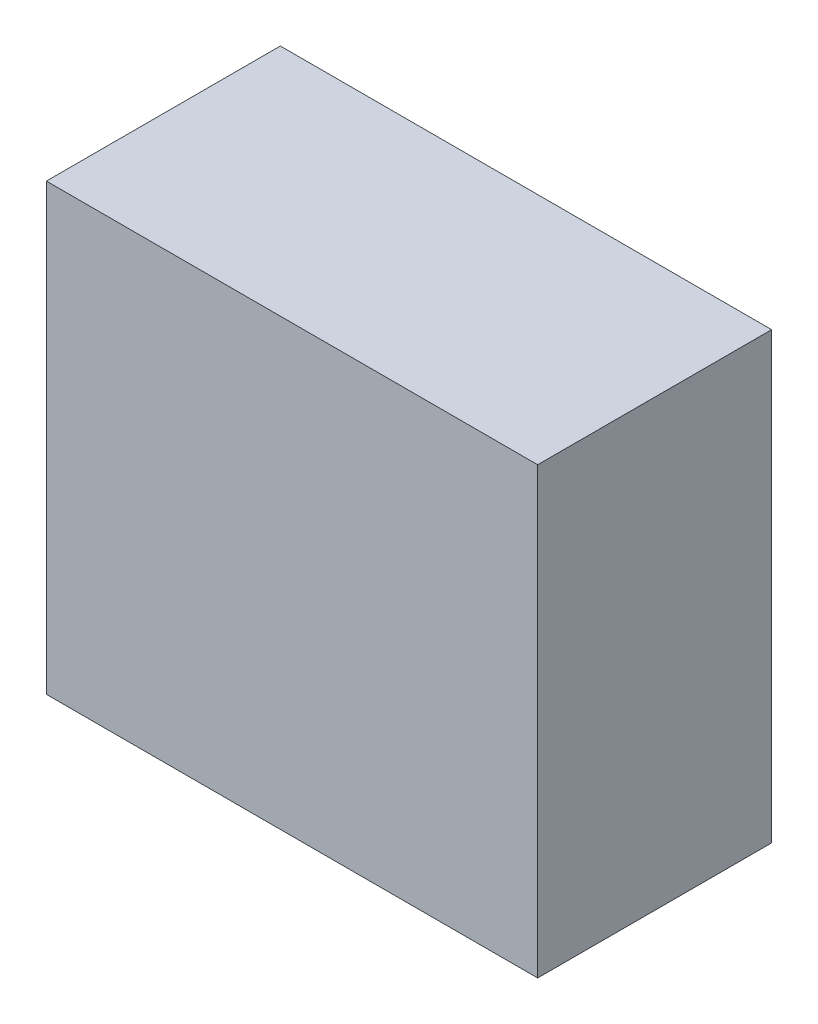
ISO-10303-21;
HEADER;
FILE_DESCRIPTION(('STEP AP214'),'2;1');
FILE_NAME('part.step','',(''),(''),'','','');
FILE_SCHEMA(('AUTOMOTIVE_DESIGN { 1 0 10303 214 1 1 1 1 }'));
ENDSEC;
DATA;
#1=APPLICATION_CONTEXT('core data for automotive mechanical design processes');
#2=APPLICATION_PROTOCOL_DEFINITION('international standard','automotive_design',2000,#1);
#3=PRODUCT_CONTEXT('',#1,'mechanical');
#4=PRODUCT('Part','Part','',(#3));
#5=PRODUCT_RELATED_PRODUCT_CATEGORY('part','',(#4));
#6=PRODUCT_DEFINITION_FORMATION('','',#4);
#7=PRODUCT_DEFINITION_CONTEXT('part definition',#1,'design');
#8=PRODUCT_DEFINITION('design','',#6,#7);
#9=PRODUCT_DEFINITION_SHAPE('','',#8);
#10=(LENGTH_UNIT() NAMED_UNIT(*) SI_UNIT(.MILLI.,.METRE.));
#11=(NAMED_UNIT(*) PLANE_ANGLE_UNIT() SI_UNIT($,.RADIAN.));
#12=(NAMED_UNIT(*) SI_UNIT($,.STERADIAN.) SOLID_ANGLE_UNIT());
#13=UNCERTAINTY_MEASURE_WITH_UNIT(LENGTH_MEASURE(1.E-05),#10,'distance_accuracy_value','');
#14=(GEOMETRIC_REPRESENTATION_CONTEXT(3) GLOBAL_UNCERTAINTY_ASSIGNED_CONTEXT((#13)) GLOBAL_UNIT_ASSIGNED_CONTEXT((#10,
#11,#12)) REPRESENTATION_CONTEXT('',''));
#15=CARTESIAN_POINT('',(0.,0.,0.));
#16=DIRECTION('',(0.,0.,1.));
#17=DIRECTION('',(1.,0.,0.));
#18=AXIS2_PLACEMENT_3D('',#15,#16,#17);
#19=CARTESIAN_POINT('',(0.52500022,-0.47500032,0.499999));
#20=DIRECTION('',(0.,0.,-1.));
#21=DIRECTION('',(-1.,0.,0.));
#22=AXIS2_PLACEMENT_3D('',#19,#20,#21);
#23=PLANE('',#22);
#24=DIRECTION('',(1.,0.,0.));
#25=VECTOR('',#24,1.);
#26=CARTESIAN_POINT('',(0.52500022,0.47500032,0.499999));
#27=LINE('',#26,#25);
#28=CARTESIAN_POINT('',(0.52500022,0.47500032,0.499999));
#29=VERTEX_POINT('',#28);
#30=CARTESIAN_POINT('',(-0.52500022,0.47500032,0.499999));
#31=VERTEX_POINT('',#30);
#32=EDGE_CURVE('E54',#29,#31,#27,.F.);
#33=ORIENTED_EDGE('',*,*,#32,.T.);
#34=DIRECTION('',(0.,1.,0.));
#35=VECTOR('',#34,1.);
#36=CARTESIAN_POINT('',(-0.52500022,0.47500032,0.499999));
#37=LINE('',#36,#35);
#38=CARTESIAN_POINT('',(-0.52500022,-0.47500032,0.499999));
#39=VERTEX_POINT('',#38);
#40=EDGE_CURVE('E56',#31,#39,#37,.F.);
#41=ORIENTED_EDGE('',*,*,#40,.T.);
#42=DIRECTION('',(1.,0.,0.));
#43=VECTOR('',#42,1.);
#44=CARTESIAN_POINT('',(-0.52500022,-0.47500032,0.499999));
#45=LINE('',#44,#43);
#46=CARTESIAN_POINT('',(0.52500022,-0.47500032,0.499999));
#47=VERTEX_POINT('',#46);
#48=EDGE_CURVE('E19',#39,#47,#45,.T.);
#49=ORIENTED_EDGE('',*,*,#48,.T.);
#50=DIRECTION('',(0.,1.,0.));
#51=VECTOR('',#50,1.);
#52=CARTESIAN_POINT('',(0.52500022,-0.47500032,0.499999));
#53=LINE('',#52,#51);
#54=EDGE_CURVE('E79',#47,#29,#53,.T.);
#55=ORIENTED_EDGE('',*,*,#54,.T.);
#56=EDGE_LOOP('',(#33,#41,#49,#55));
#57=FACE_BOUND('',#56,.T.);
#58=ADVANCED_FACE('F16',(#57),#23,.F.);
#59=CARTESIAN_POINT('',(-0.52500022,-0.47500032,0.));
#60=DIRECTION('',(0.,1.,0.));
#61=DIRECTION('',(0.,0.,1.));
#62=AXIS2_PLACEMENT_3D('',#59,#60,#61);
#63=PLANE('',#62);
#64=DIRECTION('',(0.,0.,1.));
#65=VECTOR('',#64,1.);
#66=CARTESIAN_POINT('',(0.52500022,-0.47500032,0.));
#67=LINE('',#66,#65);
#68=CARTESIAN_POINT('',(0.52500022,-0.47500032,0.));
#69=VERTEX_POINT('',#68);
#70=EDGE_CURVE('E67',#69,#47,#67,.T.);
#71=ORIENTED_EDGE('',*,*,#70,.T.);
#72=ORIENTED_EDGE('',*,*,#48,.F.);
#73=DIRECTION('',(0.,0.,-1.));
#74=VECTOR('',#73,1.);
#75=CARTESIAN_POINT('',(-0.52500022,-0.47500032,0.));
#76=LINE('',#75,#74);
#77=CARTESIAN_POINT('',(-0.52500022,-0.47500032,0.));
#78=VERTEX_POINT('',#77);
#79=EDGE_CURVE('E62',#39,#78,#76,.T.);
#80=ORIENTED_EDGE('',*,*,#79,.T.);
#81=DIRECTION('',(-1.,0.,0.));
#82=VECTOR('',#81,1.);
#83=CARTESIAN_POINT('',(0.52500022,-0.47500032,0.));
#84=LINE('',#83,#82);
#85=EDGE_CURVE('E82',#69,#78,#84,.T.);
#86=ORIENTED_EDGE('',*,*,#85,.F.);
#87=EDGE_LOOP('',(#71,#72,#80,#86));
#88=FACE_BOUND('',#87,.T.);
#89=ADVANCED_FACE('F64',(#88),#63,.F.);
#90=CARTESIAN_POINT('',(-0.52500022,0.47500032,0.));
#91=DIRECTION('',(1.,0.,0.));
#92=DIRECTION('',(0.,0.,-1.));
#93=AXIS2_PLACEMENT_3D('',#90,#91,#92);
#94=PLANE('',#93);
#95=ORIENTED_EDGE('',*,*,#79,.F.);
#96=ORIENTED_EDGE('',*,*,#40,.F.);
#97=DIRECTION('',(0.,0.,-1.));
#98=VECTOR('',#97,1.);
#99=CARTESIAN_POINT('',(-0.52500022,0.47500032,0.));
#100=LINE('',#99,#98);
#101=CARTESIAN_POINT('',(-0.52500022,0.47500032,0.));
#102=VERTEX_POINT('',#101);
#103=EDGE_CURVE('E74',#31,#102,#100,.T.);
#104=ORIENTED_EDGE('',*,*,#103,.T.);
#105=DIRECTION('',(0.,1.,0.));
#106=VECTOR('',#105,1.);
#107=CARTESIAN_POINT('',(-0.52500022,-0.47500032,0.));
#108=LINE('',#107,#106);
#109=EDGE_CURVE('E71',#78,#102,#108,.T.);
#110=ORIENTED_EDGE('',*,*,#109,.F.);
#111=EDGE_LOOP('',(#95,#96,#104,#110));
#112=FACE_BOUND('',#111,.T.);
#113=ADVANCED_FACE('F69',(#112),#94,.F.);
#114=CARTESIAN_POINT('',(0.52500022,0.47500032,0.));
#115=DIRECTION('',(0.,-1.,0.));
#116=DIRECTION('',(0.,0.,-1.));
#117=AXIS2_PLACEMENT_3D('',#114,#115,#116);
#118=PLANE('',#117);
#119=ORIENTED_EDGE('',*,*,#103,.F.);
#120=ORIENTED_EDGE('',*,*,#32,.F.);
#121=DIRECTION('',(0.,0.,1.));
#122=VECTOR('',#121,1.);
#123=CARTESIAN_POINT('',(0.52500022,0.47500032,0.));
#124=LINE('',#123,#122);
#125=CARTESIAN_POINT('',(0.52500022,0.47500032,0.));
#126=VERTEX_POINT('',#125);
#127=EDGE_CURVE('E34',#29,#126,#124,.F.);
#128=ORIENTED_EDGE('',*,*,#127,.T.);
#129=DIRECTION('',(-1.,0.,0.));
#130=VECTOR('',#129,1.);
#131=CARTESIAN_POINT('',(0.52500022,0.47500032,0.));
#132=LINE('',#131,#130);
#133=EDGE_CURVE('E25',#102,#126,#132,.F.);
#134=ORIENTED_EDGE('',*,*,#133,.F.);
#135=EDGE_LOOP('',(#119,#120,#128,#134));
#136=FACE_BOUND('',#135,.T.);
#137=ADVANCED_FACE('F88',(#136),#118,.F.);
#138=CARTESIAN_POINT('',(0.52500022,-0.47500032,0.));
#139=DIRECTION('',(-1.,0.,0.));
#140=DIRECTION('',(0.,0.,1.));
#141=AXIS2_PLACEMENT_3D('',#138,#139,#140);
#142=PLANE('',#141);
#143=ORIENTED_EDGE('',*,*,#127,.F.);
#144=ORIENTED_EDGE('',*,*,#54,.F.);
#145=ORIENTED_EDGE('',*,*,#70,.F.);
#146=DIRECTION('',(0.,1.,0.));
#147=VECTOR('',#146,1.);
#148=CARTESIAN_POINT('',(0.52500022,-0.47500032,0.));
#149=LINE('',#148,#147);
#150=EDGE_CURVE('E11',#126,#69,#149,.F.);
#151=ORIENTED_EDGE('',*,*,#150,.F.);
#152=EDGE_LOOP('',(#143,#144,#145,#151));
#153=FACE_BOUND('',#152,.T.);
#154=ADVANCED_FACE('F90',(#153),#142,.F.);
#155=CARTESIAN_POINT('',(0.52500022,-0.47500032,0.));
#156=DIRECTION('',(0.,0.,-1.));
#157=DIRECTION('',(-1.,0.,0.));
#158=AXIS2_PLACEMENT_3D('',#155,#156,#157);
#159=PLANE('',#158);
#160=ORIENTED_EDGE('',*,*,#133,.T.);
#161=ORIENTED_EDGE('',*,*,#150,.T.);
#162=ORIENTED_EDGE('',*,*,#85,.T.);
#163=ORIENTED_EDGE('',*,*,#109,.T.);
#164=EDGE_LOOP('',(#160,#161,#162,#163));
#165=FACE_BOUND('',#164,.T.);
#166=ADVANCED_FACE('F87',(#165),#159,.T.);
#167=CLOSED_SHELL('',(#58,#89,#113,#137,#154,#166));
#168=MANIFOLD_SOLID_BREP('B1',#167);
#169=ADVANCED_BREP_SHAPE_REPRESENTATION('',(#18,#168),#14);
#170=SHAPE_DEFINITION_REPRESENTATION(#9,#169);
ENDSEC;
END-ISO-10303-21;
